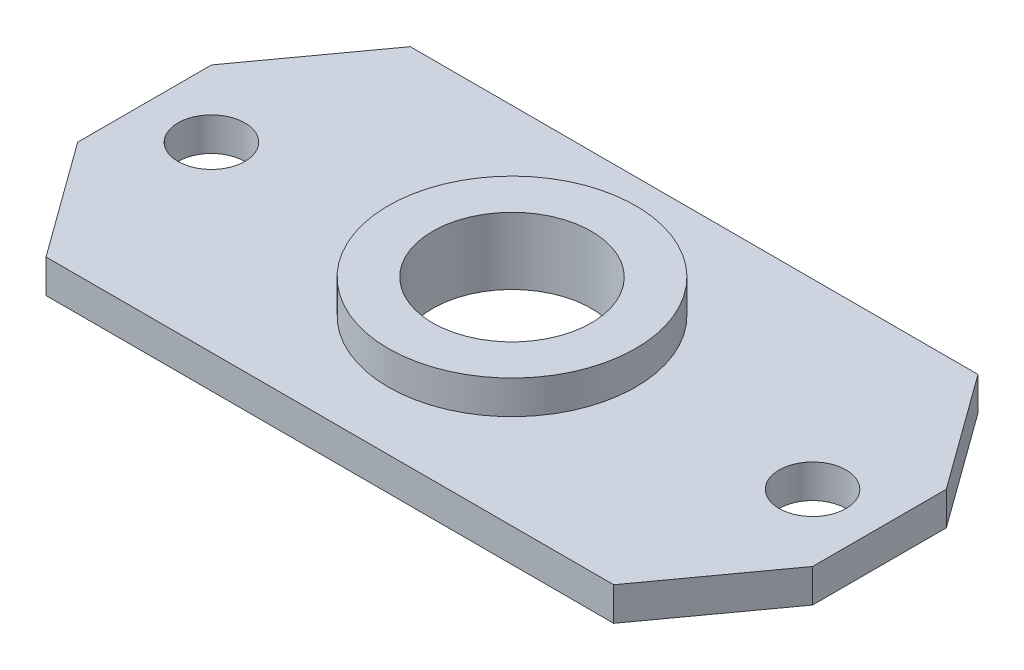
ISO-10303-21;
HEADER;
FILE_DESCRIPTION(('STEP AP214'),'2;1');
FILE_NAME('part.step','',(''),(''),'','','');
FILE_SCHEMA(('AUTOMOTIVE_DESIGN { 1 0 10303 214 1 1 1 1 }'));
ENDSEC;
DATA;
#1=APPLICATION_CONTEXT('core data for automotive mechanical design processes');
#2=APPLICATION_PROTOCOL_DEFINITION('international standard','automotive_design',2000,#1);
#3=PRODUCT_CONTEXT('',#1,'mechanical');
#4=PRODUCT('Part','Part','',(#3));
#5=PRODUCT_RELATED_PRODUCT_CATEGORY('part','',(#4));
#6=PRODUCT_DEFINITION_FORMATION('','',#4);
#7=PRODUCT_DEFINITION_CONTEXT('part definition',#1,'design');
#8=PRODUCT_DEFINITION('design','',#6,#7);
#9=PRODUCT_DEFINITION_SHAPE('','',#8);
#10=(LENGTH_UNIT() NAMED_UNIT(*) SI_UNIT(.MILLI.,.METRE.));
#11=(NAMED_UNIT(*) PLANE_ANGLE_UNIT() SI_UNIT($,.RADIAN.));
#12=(NAMED_UNIT(*) SI_UNIT($,.STERADIAN.) SOLID_ANGLE_UNIT());
#13=UNCERTAINTY_MEASURE_WITH_UNIT(LENGTH_MEASURE(1.E-05),#10,'distance_accuracy_value','');
#14=(GEOMETRIC_REPRESENTATION_CONTEXT(3) GLOBAL_UNCERTAINTY_ASSIGNED_CONTEXT((#13)) GLOBAL_UNIT_ASSIGNED_CONTEXT((#10,
#11,#12)) REPRESENTATION_CONTEXT('',''));
#15=CARTESIAN_POINT('',(0.,0.,0.));
#16=DIRECTION('',(0.,0.,1.));
#17=DIRECTION('',(1.,0.,0.));
#18=AXIS2_PLACEMENT_3D('',#15,#16,#17);
#19=CARTESIAN_POINT('',(22.2562778648358,2.,16.1394328243914));
#20=DIRECTION('',(0.809547668944308,0.,0.587054147167735));
#21=DIRECTION('',(0.587054147167735,0.,-0.809547668944308));
#22=AXIS2_PLACEMENT_3D('',#19,#20,#21);
#23=PLANE('',#22);
#24=DIRECTION('',(-0.587054147167735,0.,0.809547668944308));
#25=VECTOR('',#24,1.);
#26=CARTESIAN_POINT('',(22.2562778648358,0.,16.1394328243914));
#27=LINE('',#26,#25);
#28=CARTESIAN_POINT('',(38.96,0.,-6.895));
#29=VERTEX_POINT('',#28);
#30=CARTESIAN_POINT('',(33.96,0.,0.));
#31=VERTEX_POINT('',#30);
#32=EDGE_CURVE('E137',#29,#31,#27,.T.);
#33=ORIENTED_EDGE('',*,*,#32,.F.);
#34=DIRECTION('',(0.,-1.,0.));
#35=VECTOR('',#34,1.);
#36=CARTESIAN_POINT('',(38.96,2.,-6.895));
#37=LINE('',#36,#35);
#38=CARTESIAN_POINT('',(38.96,2.,-6.895));
#39=VERTEX_POINT('',#38);
#40=EDGE_CURVE('E38',#39,#29,#37,.T.);
#41=ORIENTED_EDGE('',*,*,#40,.F.);
#42=DIRECTION('',(-0.587054147167735,0.,0.809547668944308));
#43=VECTOR('',#42,1.);
#44=CARTESIAN_POINT('',(22.2562778648358,2.,16.1394328243914));
#45=LINE('',#44,#43);
#46=CARTESIAN_POINT('',(33.96,2.,0.));
#47=VERTEX_POINT('',#46);
#48=EDGE_CURVE('E162',#39,#47,#45,.T.);
#49=ORIENTED_EDGE('',*,*,#48,.T.);
#50=DIRECTION('',(0.,-1.,0.));
#51=VECTOR('',#50,1.);
#52=CARTESIAN_POINT('',(33.96,2.,0.));
#53=LINE('',#52,#51);
#54=EDGE_CURVE('E88',#47,#31,#53,.T.);
#55=ORIENTED_EDGE('',*,*,#54,.T.);
#56=EDGE_LOOP('',(#33,#41,#49,#55));
#57=FACE_BOUND('',#56,.T.);
#58=ADVANCED_FACE('F35',(#57),#23,.T.);
#59=CARTESIAN_POINT('',(38.96,2.,0.));
#60=DIRECTION('',(1.,0.,0.));
#61=DIRECTION('',(0.,0.,-1.));
#62=AXIS2_PLACEMENT_3D('',#59,#60,#61);
#63=PLANE('',#62);
#64=DIRECTION('',(0.,0.,1.));
#65=VECTOR('',#64,1.);
#66=CARTESIAN_POINT('',(38.96,0.,0.));
#67=LINE('',#66,#65);
#68=CARTESIAN_POINT('',(38.96,0.,-14.895));
#69=VERTEX_POINT('',#68);
#70=EDGE_CURVE('E140',#69,#29,#67,.T.);
#71=ORIENTED_EDGE('',*,*,#70,.F.);
#72=DIRECTION('',(0.,-1.,0.));
#73=VECTOR('',#72,1.);
#74=CARTESIAN_POINT('',(38.96,2.,-14.895));
#75=LINE('',#74,#73);
#76=CARTESIAN_POINT('',(38.96,2.,-14.895));
#77=VERTEX_POINT('',#76);
#78=EDGE_CURVE('E169',#77,#69,#75,.T.);
#79=ORIENTED_EDGE('',*,*,#78,.F.);
#80=DIRECTION('',(0.,0.,1.));
#81=VECTOR('',#80,1.);
#82=CARTESIAN_POINT('',(38.96,2.,0.));
#83=LINE('',#82,#81);
#84=EDGE_CURVE('E178',#77,#39,#83,.T.);
#85=ORIENTED_EDGE('',*,*,#84,.T.);
#86=ORIENTED_EDGE('',*,*,#40,.T.);
#87=EDGE_LOOP('',(#71,#79,#85,#86));
#88=FACE_BOUND('',#87,.T.);
#89=ADVANCED_FACE('F176',(#88),#63,.T.);
#90=CARTESIAN_POINT('',(32.6119386788373,2.,-23.6489765618834));
#91=DIRECTION('',(0.809547668944308,0.,-0.587054147167735));
#92=DIRECTION('',(-0.587054147167735,0.,-0.809547668944308));
#93=AXIS2_PLACEMENT_3D('',#90,#91,#92);
#94=PLANE('',#93);
#95=DIRECTION('',(0.587054147167736,0.,0.809547668944308));
#96=VECTOR('',#95,1.);
#97=CARTESIAN_POINT('',(32.6119386788373,0.,-23.6489765618834));
#98=LINE('',#97,#96);
#99=CARTESIAN_POINT('',(33.96,0.,-21.79));
#100=VERTEX_POINT('',#99);
#101=EDGE_CURVE('E144',#100,#69,#98,.T.);
#102=ORIENTED_EDGE('',*,*,#101,.F.);
#103=DIRECTION('',(0.,-1.,0.));
#104=VECTOR('',#103,1.);
#105=CARTESIAN_POINT('',(33.96,2.,-21.79));
#106=LINE('',#105,#104);
#107=CARTESIAN_POINT('',(33.96,2.,-21.79));
#108=VERTEX_POINT('',#107);
#109=EDGE_CURVE('E168',#108,#100,#106,.T.);
#110=ORIENTED_EDGE('',*,*,#109,.F.);
#111=DIRECTION('',(0.587054147167736,0.,0.809547668944308));
#112=VECTOR('',#111,1.);
#113=CARTESIAN_POINT('',(32.6119386788373,2.,-23.6489765618834));
#114=LINE('',#113,#112);
#115=EDGE_CURVE('E187',#108,#77,#114,.T.);
#116=ORIENTED_EDGE('',*,*,#115,.T.);
#117=ORIENTED_EDGE('',*,*,#78,.T.);
#118=EDGE_LOOP('',(#102,#110,#116,#117));
#119=FACE_BOUND('',#118,.T.);
#120=ADVANCED_FACE('F185',(#119),#94,.T.);
#121=CARTESIAN_POINT('',(0.,2.,-21.79));
#122=DIRECTION('',(0.,0.,-1.));
#123=DIRECTION('',(-1.,0.,0.));
#124=AXIS2_PLACEMENT_3D('',#121,#122,#123);
#125=PLANE('',#124);
#126=DIRECTION('',(1.,0.,0.));
#127=VECTOR('',#126,1.);
#128=CARTESIAN_POINT('',(0.,0.,-21.79));
#129=LINE('',#128,#127);
#130=CARTESIAN_POINT('',(0.,0.,-21.79));
#131=VERTEX_POINT('',#130);
#132=EDGE_CURVE('E147',#131,#100,#129,.T.);
#133=ORIENTED_EDGE('',*,*,#132,.F.);
#134=DIRECTION('',(0.,-1.,0.));
#135=VECTOR('',#134,1.);
#136=CARTESIAN_POINT('',(0.,2.,-21.79));
#137=LINE('',#136,#135);
#138=CARTESIAN_POINT('',(0.,2.,-21.79));
#139=VERTEX_POINT('',#138);
#140=EDGE_CURVE('E166',#139,#131,#137,.T.);
#141=ORIENTED_EDGE('',*,*,#140,.F.);
#142=DIRECTION('',(1.,0.,0.));
#143=VECTOR('',#142,1.);
#144=CARTESIAN_POINT('',(0.,2.,-21.79));
#145=LINE('',#144,#143);
#146=EDGE_CURVE('E190',#139,#108,#145,.T.);
#147=ORIENTED_EDGE('',*,*,#146,.T.);
#148=ORIENTED_EDGE('',*,*,#109,.T.);
#149=EDGE_LOOP('',(#133,#141,#147,#148));
#150=FACE_BOUND('',#149,.T.);
#151=ADVANCED_FACE('F192',(#150),#125,.T.);
#152=CARTESIAN_POINT('',(-10.3556608140015,2.,-7.509543737492));
#153=DIRECTION('',(0.809547668944308,0.,0.587054147167736));
#154=DIRECTION('',(0.587054147167736,0.,-0.809547668944308));
#155=AXIS2_PLACEMENT_3D('',#152,#153,#154);
#156=PLANE('',#155);
#157=DIRECTION('',(-0.587054147167736,0.,0.809547668944308));
#158=VECTOR('',#157,1.);
#159=CARTESIAN_POINT('',(-10.3556608140015,0.,-7.509543737492));
#160=LINE('',#159,#158);
#161=CARTESIAN_POINT('',(-5.00000000000001,0.,-14.895));
#162=VERTEX_POINT('',#161);
#163=EDGE_CURVE('E150',#131,#162,#160,.T.);
#164=ORIENTED_EDGE('',*,*,#163,.T.);
#165=DIRECTION('',(0.,-1.,0.));
#166=VECTOR('',#165,1.);
#167=CARTESIAN_POINT('',(-5.00000000000001,2.,-14.895));
#168=LINE('',#167,#166);
#169=CARTESIAN_POINT('',(-5.00000000000001,2.,-14.895));
#170=VERTEX_POINT('',#169);
#171=EDGE_CURVE('E123',#170,#162,#168,.T.);
#172=ORIENTED_EDGE('',*,*,#171,.F.);
#173=DIRECTION('',(-0.587054147167736,0.,0.809547668944308));
#174=VECTOR('',#173,1.);
#175=CARTESIAN_POINT('',(-10.3556608140015,2.,-7.509543737492));
#176=LINE('',#175,#174);
#177=EDGE_CURVE('E114',#139,#170,#176,.T.);
#178=ORIENTED_EDGE('',*,*,#177,.F.);
#179=ORIENTED_EDGE('',*,*,#140,.T.);
#180=EDGE_LOOP('',(#164,#172,#178,#179));
#181=FACE_BOUND('',#180,.T.);
#182=ADVANCED_FACE('F247',(#181),#156,.F.);
#183=CARTESIAN_POINT('',(-5.,2.,0.));
#184=DIRECTION('',(1.,0.,0.));
#185=DIRECTION('',(0.,0.,-1.));
#186=AXIS2_PLACEMENT_3D('',#183,#184,#185);
#187=PLANE('',#186);
#188=DIRECTION('',(0.,0.,1.));
#189=VECTOR('',#188,1.);
#190=CARTESIAN_POINT('',(-5.,0.,0.));
#191=LINE('',#190,#189);
#192=CARTESIAN_POINT('',(-5.,0.,-6.89499999999999));
#193=VERTEX_POINT('',#192);
#194=EDGE_CURVE('E122',#162,#193,#191,.T.);
#195=ORIENTED_EDGE('',*,*,#194,.T.);
#196=DIRECTION('',(0.,-1.,0.));
#197=VECTOR('',#196,1.);
#198=CARTESIAN_POINT('',(-5.,2.,-6.89499999999999));
#199=LINE('',#198,#197);
#200=CARTESIAN_POINT('',(-5.,2.,-6.89499999999999));
#201=VERTEX_POINT('',#200);
#202=EDGE_CURVE('E119',#201,#193,#199,.T.);
#203=ORIENTED_EDGE('',*,*,#202,.F.);
#204=DIRECTION('',(0.,0.,1.));
#205=VECTOR('',#204,1.);
#206=CARTESIAN_POINT('',(-5.,2.,0.));
#207=LINE('',#206,#205);
#208=EDGE_CURVE('E106',#170,#201,#207,.T.);
#209=ORIENTED_EDGE('',*,*,#208,.F.);
#210=ORIENTED_EDGE('',*,*,#171,.T.);
#211=EDGE_LOOP('',(#195,#203,#209,#210));
#212=FACE_BOUND('',#211,.T.);
#213=ADVANCED_FACE('F120',(#212),#187,.F.);
#214=CARTESIAN_POINT('',(0.,2.,0.));
#215=DIRECTION('',(0.809547668944307,0.,-0.587054147167736));
#216=DIRECTION('',(-0.587054147167736,0.,-0.809547668944307));
#217=AXIS2_PLACEMENT_3D('',#214,#215,#216);
#218=PLANE('',#217);
#219=DIRECTION('',(0.587054147167736,0.,0.809547668944307));
#220=VECTOR('',#219,1.);
#221=CARTESIAN_POINT('',(0.,0.,0.));
#222=LINE('',#221,#220);
#223=CARTESIAN_POINT('',(0.,0.,0.));
#224=VERTEX_POINT('',#223);
#225=EDGE_CURVE('E81',#193,#224,#222,.T.);
#226=ORIENTED_EDGE('',*,*,#225,.T.);
#227=DIRECTION('',(0.,-1.,0.));
#228=VECTOR('',#227,1.);
#229=CARTESIAN_POINT('',(0.,2.,0.));
#230=LINE('',#229,#228);
#231=CARTESIAN_POINT('',(0.,2.,0.));
#232=VERTEX_POINT('',#231);
#233=EDGE_CURVE('E124',#232,#224,#230,.T.);
#234=ORIENTED_EDGE('',*,*,#233,.F.);
#235=DIRECTION('',(0.587054147167736,0.,0.809547668944307));
#236=VECTOR('',#235,1.);
#237=CARTESIAN_POINT('',(0.,2.,0.));
#238=LINE('',#237,#236);
#239=EDGE_CURVE('E111',#201,#232,#238,.T.);
#240=ORIENTED_EDGE('',*,*,#239,.F.);
#241=ORIENTED_EDGE('',*,*,#202,.T.);
#242=EDGE_LOOP('',(#226,#234,#240,#241));
#243=FACE_BOUND('',#242,.T.);
#244=ADVANCED_FACE('F126',(#243),#218,.F.);
#245=CARTESIAN_POINT('',(-1.,2.,-10.895));
#246=DIRECTION('',(0.,-1.,0.));
#247=DIRECTION('',(0.,0.,-1.));
#248=AXIS2_PLACEMENT_3D('',#245,#246,#247);
#249=CYLINDRICAL_SURFACE('',#248,2.);
#250=CARTESIAN_POINT('',(-1.,2.,-10.895));
#251=DIRECTION('',(0.,1.,0.));
#252=DIRECTION('',(0.,0.,1.));
#253=AXIS2_PLACEMENT_3D('',#250,#251,#252);
#254=CIRCLE('',#253,2.);
#255=CARTESIAN_POINT('',(-1.,2.,-8.895));
#256=VERTEX_POINT('',#255);
#257=EDGE_CURVE('E128',#256,#256,#254,.T.);
#258=ORIENTED_EDGE('',*,*,#257,.T.);
#259=EDGE_LOOP('',(#258));
#260=FACE_BOUND('',#259,.T.);
#261=CARTESIAN_POINT('',(-1.,0.,-10.895));
#262=DIRECTION('',(0.,1.,0.));
#263=DIRECTION('',(0.,0.,1.));
#264=AXIS2_PLACEMENT_3D('',#261,#262,#263);
#265=CIRCLE('',#264,2.);
#266=CARTESIAN_POINT('',(-1.,0.,-8.895));
#267=VERTEX_POINT('',#266);
#268=EDGE_CURVE('E156',#267,#267,#265,.T.);
#269=ORIENTED_EDGE('',*,*,#268,.F.);
#270=EDGE_LOOP('',(#269));
#271=FACE_BOUND('',#270,.T.);
#272=ADVANCED_FACE('F255',(#260,#271),#249,.F.);
#273=CARTESIAN_POINT('',(0.,2.,0.));
#274=DIRECTION('',(0.,0.,-1.));
#275=DIRECTION('',(-1.,0.,0.));
#276=AXIS2_PLACEMENT_3D('',#273,#274,#275);
#277=PLANE('',#276);
#278=DIRECTION('',(1.,0.,0.));
#279=VECTOR('',#278,1.);
#280=CARTESIAN_POINT('',(0.,0.,0.));
#281=LINE('',#280,#279);
#282=EDGE_CURVE('E154',#224,#31,#281,.T.);
#283=ORIENTED_EDGE('',*,*,#282,.T.);
#284=ORIENTED_EDGE('',*,*,#54,.F.);
#285=DIRECTION('',(1.,0.,0.));
#286=VECTOR('',#285,1.);
#287=CARTESIAN_POINT('',(0.,2.,0.));
#288=LINE('',#287,#286);
#289=EDGE_CURVE('E52',#232,#47,#288,.T.);
#290=ORIENTED_EDGE('',*,*,#289,.F.);
#291=ORIENTED_EDGE('',*,*,#233,.T.);
#292=EDGE_LOOP('',(#283,#284,#290,#291));
#293=FACE_BOUND('',#292,.T.);
#294=ADVANCED_FACE('F233',(#293),#277,.F.);
#295=CARTESIAN_POINT('',(34.96,2.,-10.895));
#296=DIRECTION('',(0.,-1.,0.));
#297=DIRECTION('',(0.,0.,-1.));
#298=AXIS2_PLACEMENT_3D('',#295,#296,#297);
#299=CYLINDRICAL_SURFACE('',#298,2.);
#300=CARTESIAN_POINT('',(34.96,2.,-10.895));
#301=DIRECTION('',(0.,1.,0.));
#302=DIRECTION('',(0.,0.,1.));
#303=AXIS2_PLACEMENT_3D('',#300,#301,#302);
#304=CIRCLE('',#303,2.);
#305=CARTESIAN_POINT('',(34.96,2.,-8.895));
#306=VERTEX_POINT('',#305);
#307=EDGE_CURVE('E134',#306,#306,#304,.F.);
#308=ORIENTED_EDGE('',*,*,#307,.F.);
#309=EDGE_LOOP('',(#308));
#310=FACE_BOUND('',#309,.T.);
#311=CARTESIAN_POINT('',(34.96,0.,-10.895));
#312=DIRECTION('',(0.,1.,0.));
#313=DIRECTION('',(0.,0.,1.));
#314=AXIS2_PLACEMENT_3D('',#311,#312,#313);
#315=CIRCLE('',#314,2.);
#316=CARTESIAN_POINT('',(34.96,0.,-8.895));
#317=VERTEX_POINT('',#316);
#318=EDGE_CURVE('E159',#317,#317,#315,.F.);
#319=ORIENTED_EDGE('',*,*,#318,.T.);
#320=EDGE_LOOP('',(#319));
#321=FACE_BOUND('',#320,.T.);
#322=ADVANCED_FACE('F226',(#310,#321),#299,.F.);
#323=CARTESIAN_POINT('',(0.,2.,0.));
#324=DIRECTION('',(0.,1.,0.));
#325=DIRECTION('',(0.,0.,1.));
#326=AXIS2_PLACEMENT_3D('',#323,#324,#325);
#327=PLANE('',#326);
#328=CARTESIAN_POINT('',(16.98,2.,-10.895));
#329=DIRECTION('',(0.,1.,0.));
#330=DIRECTION('',(0.,0.,1.));
#331=AXIS2_PLACEMENT_3D('',#328,#329,#330);
#332=CIRCLE('',#331,7.4);
#333=CARTESIAN_POINT('',(16.98,2.,-3.495));
#334=VERTEX_POINT('',#333);
#335=EDGE_CURVE('E11',#334,#334,#332,.T.);
#336=ORIENTED_EDGE('',*,*,#335,.F.);
#337=EDGE_LOOP('',(#336));
#338=FACE_BOUND('',#337,.T.);
#339=ORIENTED_EDGE('',*,*,#48,.F.);
#340=ORIENTED_EDGE('',*,*,#84,.F.);
#341=ORIENTED_EDGE('',*,*,#115,.F.);
#342=ORIENTED_EDGE('',*,*,#146,.F.);
#343=ORIENTED_EDGE('',*,*,#177,.T.);
#344=ORIENTED_EDGE('',*,*,#208,.T.);
#345=ORIENTED_EDGE('',*,*,#239,.T.);
#346=ORIENTED_EDGE('',*,*,#289,.T.);
#347=EDGE_LOOP('',(#339,#340,#341,#342,#343,#344,#345,#346));
#348=FACE_BOUND('',#347,.T.);
#349=ORIENTED_EDGE('',*,*,#257,.F.);
#350=EDGE_LOOP('',(#349));
#351=FACE_BOUND('',#350,.T.);
#352=ORIENTED_EDGE('',*,*,#307,.T.);
#353=EDGE_LOOP('',(#352));
#354=FACE_BOUND('',#353,.T.);
#355=ADVANCED_FACE('F108',(#338,#348,#351,#354),#327,.T.);
#356=CARTESIAN_POINT('',(0.,0.,0.));
#357=DIRECTION('',(0.,1.,0.));
#358=DIRECTION('',(0.,0.,1.));
#359=AXIS2_PLACEMENT_3D('',#356,#357,#358);
#360=PLANE('',#359);
#361=CARTESIAN_POINT('',(16.98,0.,-10.895));
#362=DIRECTION('',(0.,1.,0.));
#363=DIRECTION('',(0.,0.,1.));
#364=AXIS2_PLACEMENT_3D('',#361,#362,#363);
#365=CIRCLE('',#364,4.75);
#366=CARTESIAN_POINT('',(16.98,0.,-6.145));
#367=VERTEX_POINT('',#366);
#368=EDGE_CURVE('E199',#367,#367,#365,.T.);
#369=ORIENTED_EDGE('',*,*,#368,.T.);
#370=EDGE_LOOP('',(#369));
#371=FACE_BOUND('',#370,.T.);
#372=ORIENTED_EDGE('',*,*,#32,.T.);
#373=ORIENTED_EDGE('',*,*,#282,.F.);
#374=ORIENTED_EDGE('',*,*,#225,.F.);
#375=ORIENTED_EDGE('',*,*,#194,.F.);
#376=ORIENTED_EDGE('',*,*,#163,.F.);
#377=ORIENTED_EDGE('',*,*,#132,.T.);
#378=ORIENTED_EDGE('',*,*,#101,.T.);
#379=ORIENTED_EDGE('',*,*,#70,.T.);
#380=EDGE_LOOP('',(#372,#373,#374,#375,#376,#377,#378,#379));
#381=FACE_BOUND('',#380,.T.);
#382=ORIENTED_EDGE('',*,*,#268,.T.);
#383=EDGE_LOOP('',(#382));
#384=FACE_BOUND('',#383,.T.);
#385=ORIENTED_EDGE('',*,*,#318,.F.);
#386=EDGE_LOOP('',(#385));
#387=FACE_BOUND('',#386,.T.);
#388=ADVANCED_FACE('F181',(#371,#381,#384,#387),#360,.F.);
#389=CARTESIAN_POINT('',(16.98,4.,-10.895));
#390=DIRECTION('',(0.,-1.,0.));
#391=DIRECTION('',(0.,0.,-1.));
#392=AXIS2_PLACEMENT_3D('',#389,#390,#391);
#393=CYLINDRICAL_SURFACE('',#392,7.4);
#394=CARTESIAN_POINT('',(16.98,4.,-10.895));
#395=DIRECTION('',(0.,1.,0.));
#396=DIRECTION('',(0.,0.,1.));
#397=AXIS2_PLACEMENT_3D('',#394,#395,#396);
#398=CIRCLE('',#397,7.4);
#399=CARTESIAN_POINT('',(16.98,4.,-3.495));
#400=VERTEX_POINT('',#399);
#401=EDGE_CURVE('E141',#400,#400,#398,.T.);
#402=ORIENTED_EDGE('',*,*,#401,.F.);
#403=EDGE_LOOP('',(#402));
#404=FACE_BOUND('',#403,.T.);
#405=ORIENTED_EDGE('',*,*,#335,.T.);
#406=EDGE_LOOP('',(#405));
#407=FACE_BOUND('',#406,.T.);
#408=ADVANCED_FACE('F216',(#404,#407),#393,.T.);
#409=CARTESIAN_POINT('',(16.98,4.,-10.895));
#410=DIRECTION('',(0.,1.,0.));
#411=DIRECTION('',(0.,0.,1.));
#412=AXIS2_PLACEMENT_3D('',#409,#410,#411);
#413=PLANE('',#412);
#414=CARTESIAN_POINT('',(16.98,4.,-10.895));
#415=DIRECTION('',(0.,1.,0.));
#416=DIRECTION('',(0.,0.,1.));
#417=AXIS2_PLACEMENT_3D('',#414,#415,#416);
#418=CIRCLE('',#417,4.75);
#419=CARTESIAN_POINT('',(16.98,4.,-6.145));
#420=VERTEX_POINT('',#419);
#421=EDGE_CURVE('E200',#420,#420,#418,.T.);
#422=ORIENTED_EDGE('',*,*,#421,.F.);
#423=EDGE_LOOP('',(#422));
#424=FACE_BOUND('',#423,.T.);
#425=ORIENTED_EDGE('',*,*,#401,.T.);
#426=EDGE_LOOP('',(#425));
#427=FACE_BOUND('',#426,.T.);
#428=ADVANCED_FACE('F210',(#424,#427),#413,.T.);
#429=CARTESIAN_POINT('',(16.98,0.,-10.895));
#430=DIRECTION('',(0.,1.,0.));
#431=DIRECTION('',(0.,0.,1.));
#432=AXIS2_PLACEMENT_3D('',#429,#430,#431);
#433=CYLINDRICAL_SURFACE('',#432,4.75);
#434=ORIENTED_EDGE('',*,*,#368,.F.);
#435=EDGE_LOOP('',(#434));
#436=FACE_BOUND('',#435,.T.);
#437=ORIENTED_EDGE('',*,*,#421,.T.);
#438=EDGE_LOOP('',(#437));
#439=FACE_BOUND('',#438,.T.);
#440=ADVANCED_FACE('F207',(#436,#439),#433,.F.);
#441=CLOSED_SHELL('',(#58,#89,#120,#151,#182,#213,#244,#272,#294,#322,#355,#388,#408,#428,#440));
#442=MANIFOLD_SOLID_BREP('B2',#441);
#443=ADVANCED_BREP_SHAPE_REPRESENTATION('',(#18,#442),#14);
#444=SHAPE_DEFINITION_REPRESENTATION(#9,#443);
ENDSEC;
END-ISO-10303-21;
